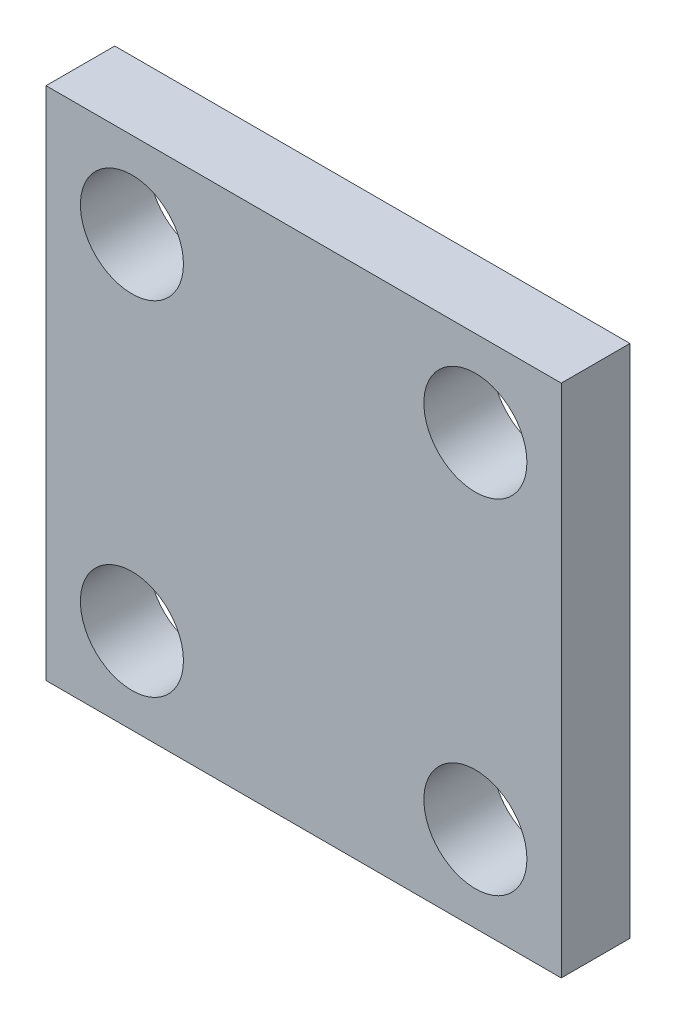
ISO-10303-21;
HEADER;
FILE_DESCRIPTION(('STEP AP214'),'2;1');
FILE_NAME('part.step','',(''),(''),'','','');
FILE_SCHEMA(('AUTOMOTIVE_DESIGN { 1 0 10303 214 1 1 1 1 }'));
ENDSEC;
DATA;
#1=APPLICATION_CONTEXT('core data for automotive mechanical design processes');
#2=APPLICATION_PROTOCOL_DEFINITION('international standard','automotive_design',2000,#1);
#3=PRODUCT_CONTEXT('',#1,'mechanical');
#4=PRODUCT('Part','Part','',(#3));
#5=PRODUCT_RELATED_PRODUCT_CATEGORY('part','',(#4));
#6=PRODUCT_DEFINITION_FORMATION('','',#4);
#7=PRODUCT_DEFINITION_CONTEXT('part definition',#1,'design');
#8=PRODUCT_DEFINITION('design','',#6,#7);
#9=PRODUCT_DEFINITION_SHAPE('','',#8);
#10=(LENGTH_UNIT() NAMED_UNIT(*) SI_UNIT(.MILLI.,.METRE.));
#11=(NAMED_UNIT(*) PLANE_ANGLE_UNIT() SI_UNIT($,.RADIAN.));
#12=(NAMED_UNIT(*) SI_UNIT($,.STERADIAN.) SOLID_ANGLE_UNIT());
#13=UNCERTAINTY_MEASURE_WITH_UNIT(LENGTH_MEASURE(1.E-05),#10,'distance_accuracy_value','');
#14=(GEOMETRIC_REPRESENTATION_CONTEXT(3) GLOBAL_UNCERTAINTY_ASSIGNED_CONTEXT((#13)) GLOBAL_UNIT_ASSIGNED_CONTEXT((#10,
#11,#12)) REPRESENTATION_CONTEXT('',''));
#15=CARTESIAN_POINT('',(0.,0.,0.));
#16=DIRECTION('',(0.,0.,1.));
#17=DIRECTION('',(1.,0.,0.));
#18=AXIS2_PLACEMENT_3D('',#15,#16,#17);
#19=CARTESIAN_POINT('',(0.,0.,8.));
#20=DIRECTION('',(0.,0.,-1.));
#21=DIRECTION('',(-1.,0.,0.));
#22=AXIS2_PLACEMENT_3D('',#19,#20,#21);
#23=PLANE('',#22);
#24=DIRECTION('',(0.,1.,0.));
#25=VECTOR('',#24,1.);
#26=CARTESIAN_POINT('',(30.,-30.,8.));
#27=LINE('',#26,#25);
#28=CARTESIAN_POINT('',(30.,-30.,8.));
#29=VERTEX_POINT('',#28);
#30=CARTESIAN_POINT('',(30.,30.,8.));
#31=VERTEX_POINT('',#30);
#32=EDGE_CURVE('E92',#29,#31,#27,.T.);
#33=ORIENTED_EDGE('',*,*,#32,.T.);
#34=DIRECTION('',(-1.,0.,0.));
#35=VECTOR('',#34,1.);
#36=CARTESIAN_POINT('',(-30.,30.,8.));
#37=LINE('',#36,#35);
#38=CARTESIAN_POINT('',(-30.,30.,8.));
#39=VERTEX_POINT('',#38);
#40=EDGE_CURVE('E87',#31,#39,#37,.T.);
#41=ORIENTED_EDGE('',*,*,#40,.T.);
#42=DIRECTION('',(0.,-1.,0.));
#43=VECTOR('',#42,1.);
#44=CARTESIAN_POINT('',(-30.,-30.,8.));
#45=LINE('',#44,#43);
#46=CARTESIAN_POINT('',(-30.,-30.,8.));
#47=VERTEX_POINT('',#46);
#48=EDGE_CURVE('E90',#39,#47,#45,.T.);
#49=ORIENTED_EDGE('',*,*,#48,.T.);
#50=DIRECTION('',(1.,0.,0.));
#51=VECTOR('',#50,1.);
#52=CARTESIAN_POINT('',(-30.,-30.,8.));
#53=LINE('',#52,#51);
#54=EDGE_CURVE('E57',#47,#29,#53,.T.);
#55=ORIENTED_EDGE('',*,*,#54,.T.);
#56=EDGE_LOOP('',(#33,#41,#49,#55));
#57=FACE_BOUND('',#56,.T.);
#58=CARTESIAN_POINT('',(-19.9999991568675,19.9999991568675,8.));
#59=DIRECTION('',(0.,0.,1.));
#60=DIRECTION('',(1.,0.,0.));
#61=AXIS2_PLACEMENT_3D('',#58,#59,#60);
#62=CIRCLE('',#61,6.);
#63=CARTESIAN_POINT('',(-13.9999991568675,19.9999991568675,8.));
#64=VERTEX_POINT('',#63);
#65=EDGE_CURVE('E112',#64,#64,#62,.T.);
#66=ORIENTED_EDGE('',*,*,#65,.F.);
#67=EDGE_LOOP('',(#66));
#68=FACE_BOUND('',#67,.T.);
#69=CARTESIAN_POINT('',(20.0000008431325,20.0000008431325,8.));
#70=DIRECTION('',(0.,0.,1.));
#71=DIRECTION('',(1.,0.,0.));
#72=AXIS2_PLACEMENT_3D('',#69,#70,#71);
#73=CIRCLE('',#72,6.);
#74=CARTESIAN_POINT('',(26.0000008431325,20.0000008431325,8.));
#75=VERTEX_POINT('',#74);
#76=EDGE_CURVE('E134',#75,#75,#73,.T.);
#77=ORIENTED_EDGE('',*,*,#76,.F.);
#78=EDGE_LOOP('',(#77));
#79=FACE_BOUND('',#78,.T.);
#80=CARTESIAN_POINT('',(-20.0000008431325,-20.0000008431325,8.));
#81=DIRECTION('',(0.,0.,1.));
#82=DIRECTION('',(1.,0.,0.));
#83=AXIS2_PLACEMENT_3D('',#80,#81,#82);
#84=CIRCLE('',#83,6.);
#85=CARTESIAN_POINT('',(-14.0000008431325,-20.0000008431325,8.));
#86=VERTEX_POINT('',#85);
#87=EDGE_CURVE('E142',#86,#86,#84,.T.);
#88=ORIENTED_EDGE('',*,*,#87,.F.);
#89=EDGE_LOOP('',(#88));
#90=FACE_BOUND('',#89,.T.);
#91=CARTESIAN_POINT('',(19.9999991568675,-19.9999991568675,8.));
#92=DIRECTION('',(0.,0.,1.));
#93=DIRECTION('',(1.,0.,0.));
#94=AXIS2_PLACEMENT_3D('',#91,#92,#93);
#95=CIRCLE('',#94,6.);
#96=CARTESIAN_POINT('',(25.9999991568675,-19.9999991568675,8.));
#97=VERTEX_POINT('',#96);
#98=EDGE_CURVE('E150',#97,#97,#95,.T.);
#99=ORIENTED_EDGE('',*,*,#98,.F.);
#100=EDGE_LOOP('',(#99));
#101=FACE_BOUND('',#100,.T.);
#102=ADVANCED_FACE('F39',(#57,#68,#79,#90,#101),#23,.F.);
#103=CARTESIAN_POINT('',(0.,0.,0.));
#104=DIRECTION('',(0.,0.,-1.));
#105=DIRECTION('',(-1.,0.,0.));
#106=AXIS2_PLACEMENT_3D('',#103,#104,#105);
#107=PLANE('',#106);
#108=CARTESIAN_POINT('',(-20.0000008431325,-20.0000008431325,0.));
#109=DIRECTION('',(0.,0.,1.));
#110=DIRECTION('',(1.,0.,0.));
#111=AXIS2_PLACEMENT_3D('',#108,#109,#110);
#112=CIRCLE('',#111,6.);
#113=CARTESIAN_POINT('',(-14.0000008431325,-20.0000008431325,0.));
#114=VERTEX_POINT('',#113);
#115=EDGE_CURVE('E146',#114,#114,#112,.T.);
#116=ORIENTED_EDGE('',*,*,#115,.T.);
#117=EDGE_LOOP('',(#116));
#118=FACE_BOUND('',#117,.T.);
#119=CARTESIAN_POINT('',(-19.9999991568675,19.9999991568675,0.));
#120=DIRECTION('',(0.,0.,1.));
#121=DIRECTION('',(1.,0.,0.));
#122=AXIS2_PLACEMENT_3D('',#119,#120,#121);
#123=CIRCLE('',#122,6.);
#124=CARTESIAN_POINT('',(-13.9999991568675,19.9999991568675,0.));
#125=VERTEX_POINT('',#124);
#126=EDGE_CURVE('E130',#125,#125,#123,.T.);
#127=ORIENTED_EDGE('',*,*,#126,.T.);
#128=EDGE_LOOP('',(#127));
#129=FACE_BOUND('',#128,.T.);
#130=DIRECTION('',(0.,1.,0.));
#131=VECTOR('',#130,1.);
#132=CARTESIAN_POINT('',(30.,-30.,0.));
#133=LINE('',#132,#131);
#134=CARTESIAN_POINT('',(30.,-30.,0.));
#135=VERTEX_POINT('',#134);
#136=CARTESIAN_POINT('',(30.,30.,0.));
#137=VERTEX_POINT('',#136);
#138=EDGE_CURVE('E108',#135,#137,#133,.T.);
#139=ORIENTED_EDGE('',*,*,#138,.F.);
#140=DIRECTION('',(1.,0.,0.));
#141=VECTOR('',#140,1.);
#142=CARTESIAN_POINT('',(-30.,-30.,0.));
#143=LINE('',#142,#141);
#144=CARTESIAN_POINT('',(-30.,-30.,0.));
#145=VERTEX_POINT('',#144);
#146=EDGE_CURVE('E80',#145,#135,#143,.T.);
#147=ORIENTED_EDGE('',*,*,#146,.F.);
#148=DIRECTION('',(0.,-1.,0.));
#149=VECTOR('',#148,1.);
#150=CARTESIAN_POINT('',(-30.,-30.,0.));
#151=LINE('',#150,#149);
#152=CARTESIAN_POINT('',(-30.,30.,0.));
#153=VERTEX_POINT('',#152);
#154=EDGE_CURVE('E74',#153,#145,#151,.T.);
#155=ORIENTED_EDGE('',*,*,#154,.F.);
#156=DIRECTION('',(-1.,0.,0.));
#157=VECTOR('',#156,1.);
#158=CARTESIAN_POINT('',(-30.,30.,0.));
#159=LINE('',#158,#157);
#160=EDGE_CURVE('E97',#137,#153,#159,.T.);
#161=ORIENTED_EDGE('',*,*,#160,.F.);
#162=EDGE_LOOP('',(#139,#147,#155,#161));
#163=FACE_BOUND('',#162,.T.);
#164=CARTESIAN_POINT('',(20.0000008431325,20.0000008431325,0.));
#165=DIRECTION('',(0.,0.,1.));
#166=DIRECTION('',(1.,0.,0.));
#167=AXIS2_PLACEMENT_3D('',#164,#165,#166);
#168=CIRCLE('',#167,6.);
#169=CARTESIAN_POINT('',(26.0000008431325,20.0000008431325,0.));
#170=VERTEX_POINT('',#169);
#171=EDGE_CURVE('E138',#170,#170,#168,.T.);
#172=ORIENTED_EDGE('',*,*,#171,.T.);
#173=EDGE_LOOP('',(#172));
#174=FACE_BOUND('',#173,.T.);
#175=CARTESIAN_POINT('',(19.9999991568675,-19.9999991568675,0.));
#176=DIRECTION('',(0.,0.,1.));
#177=DIRECTION('',(1.,0.,0.));
#178=AXIS2_PLACEMENT_3D('',#175,#176,#177);
#179=CIRCLE('',#178,6.);
#180=CARTESIAN_POINT('',(25.9999991568675,-19.9999991568675,0.));
#181=VERTEX_POINT('',#180);
#182=EDGE_CURVE('E154',#181,#181,#179,.T.);
#183=ORIENTED_EDGE('',*,*,#182,.T.);
#184=EDGE_LOOP('',(#183));
#185=FACE_BOUND('',#184,.T.);
#186=ADVANCED_FACE('F125',(#118,#129,#163,#174,#185),#107,.T.);
#187=CARTESIAN_POINT('',(30.,-30.,8.));
#188=DIRECTION('',(-1.,0.,0.));
#189=DIRECTION('',(0.,0.,1.));
#190=AXIS2_PLACEMENT_3D('',#187,#188,#189);
#191=PLANE('',#190);
#192=ORIENTED_EDGE('',*,*,#138,.T.);
#193=DIRECTION('',(0.,0.,-1.));
#194=VECTOR('',#193,1.);
#195=CARTESIAN_POINT('',(30.,30.,8.));
#196=LINE('',#195,#194);
#197=EDGE_CURVE('E11',#31,#137,#196,.T.);
#198=ORIENTED_EDGE('',*,*,#197,.F.);
#199=ORIENTED_EDGE('',*,*,#32,.F.);
#200=DIRECTION('',(0.,0.,-1.));
#201=VECTOR('',#200,1.);
#202=CARTESIAN_POINT('',(30.,-30.,8.));
#203=LINE('',#202,#201);
#204=EDGE_CURVE('E104',#29,#135,#203,.T.);
#205=ORIENTED_EDGE('',*,*,#204,.T.);
#206=EDGE_LOOP('',(#192,#198,#199,#205));
#207=FACE_BOUND('',#206,.T.);
#208=ADVANCED_FACE('F41',(#207),#191,.F.);
#209=CARTESIAN_POINT('',(-30.,30.,8.));
#210=DIRECTION('',(0.,-1.,0.));
#211=DIRECTION('',(0.,0.,-1.));
#212=AXIS2_PLACEMENT_3D('',#209,#210,#211);
#213=PLANE('',#212);
#214=ORIENTED_EDGE('',*,*,#160,.T.);
#215=DIRECTION('',(0.,0.,-1.));
#216=VECTOR('',#215,1.);
#217=CARTESIAN_POINT('',(-30.,30.,8.));
#218=LINE('',#217,#216);
#219=EDGE_CURVE('E49',#39,#153,#218,.T.);
#220=ORIENTED_EDGE('',*,*,#219,.F.);
#221=ORIENTED_EDGE('',*,*,#40,.F.);
#222=ORIENTED_EDGE('',*,*,#197,.T.);
#223=EDGE_LOOP('',(#214,#220,#221,#222));
#224=FACE_BOUND('',#223,.T.);
#225=ADVANCED_FACE('F96',(#224),#213,.F.);
#226=CARTESIAN_POINT('',(-30.,-30.,8.));
#227=DIRECTION('',(1.,0.,0.));
#228=DIRECTION('',(0.,0.,-1.));
#229=AXIS2_PLACEMENT_3D('',#226,#227,#228);
#230=PLANE('',#229);
#231=ORIENTED_EDGE('',*,*,#154,.T.);
#232=DIRECTION('',(0.,0.,-1.));
#233=VECTOR('',#232,1.);
#234=CARTESIAN_POINT('',(-30.,-30.,8.));
#235=LINE('',#234,#233);
#236=EDGE_CURVE('E99',#47,#145,#235,.T.);
#237=ORIENTED_EDGE('',*,*,#236,.F.);
#238=ORIENTED_EDGE('',*,*,#48,.F.);
#239=ORIENTED_EDGE('',*,*,#219,.T.);
#240=EDGE_LOOP('',(#231,#237,#238,#239));
#241=FACE_BOUND('',#240,.T.);
#242=ADVANCED_FACE('F100',(#241),#230,.F.);
#243=CARTESIAN_POINT('',(-30.,-30.,8.));
#244=DIRECTION('',(0.,1.,0.));
#245=DIRECTION('',(0.,0.,1.));
#246=AXIS2_PLACEMENT_3D('',#243,#244,#245);
#247=PLANE('',#246);
#248=ORIENTED_EDGE('',*,*,#146,.T.);
#249=ORIENTED_EDGE('',*,*,#204,.F.);
#250=ORIENTED_EDGE('',*,*,#54,.F.);
#251=ORIENTED_EDGE('',*,*,#236,.T.);
#252=EDGE_LOOP('',(#248,#249,#250,#251));
#253=FACE_BOUND('',#252,.T.);
#254=ADVANCED_FACE('F122',(#253),#247,.F.);
#255=CARTESIAN_POINT('',(-19.9999991568675,19.9999991568675,8.));
#256=DIRECTION('',(0.,0.,-1.));
#257=DIRECTION('',(-1.,0.,0.));
#258=AXIS2_PLACEMENT_3D('',#255,#256,#257);
#259=CYLINDRICAL_SURFACE('',#258,6.);
#260=ORIENTED_EDGE('',*,*,#65,.T.);
#261=EDGE_LOOP('',(#260));
#262=FACE_BOUND('',#261,.T.);
#263=ORIENTED_EDGE('',*,*,#126,.F.);
#264=EDGE_LOOP('',(#263));
#265=FACE_BOUND('',#264,.T.);
#266=ADVANCED_FACE('F173',(#262,#265),#259,.F.);
#267=CARTESIAN_POINT('',(20.0000008431325,20.0000008431325,8.));
#268=DIRECTION('',(0.,0.,-1.));
#269=DIRECTION('',(-1.,0.,0.));
#270=AXIS2_PLACEMENT_3D('',#267,#268,#269);
#271=CYLINDRICAL_SURFACE('',#270,6.);
#272=ORIENTED_EDGE('',*,*,#76,.T.);
#273=EDGE_LOOP('',(#272));
#274=FACE_BOUND('',#273,.T.);
#275=ORIENTED_EDGE('',*,*,#171,.F.);
#276=EDGE_LOOP('',(#275));
#277=FACE_BOUND('',#276,.T.);
#278=ADVANCED_FACE('F219',(#274,#277),#271,.F.);
#279=CARTESIAN_POINT('',(-20.0000008431325,-20.0000008431325,8.));
#280=DIRECTION('',(0.,0.,-1.));
#281=DIRECTION('',(-1.,0.,0.));
#282=AXIS2_PLACEMENT_3D('',#279,#280,#281);
#283=CYLINDRICAL_SURFACE('',#282,6.);
#284=ORIENTED_EDGE('',*,*,#87,.T.);
#285=EDGE_LOOP('',(#284));
#286=FACE_BOUND('',#285,.T.);
#287=ORIENTED_EDGE('',*,*,#115,.F.);
#288=EDGE_LOOP('',(#287));
#289=FACE_BOUND('',#288,.T.);
#290=ADVANCED_FACE('F227',(#286,#289),#283,.F.);
#291=CARTESIAN_POINT('',(19.9999991568675,-19.9999991568675,8.));
#292=DIRECTION('',(0.,0.,-1.));
#293=DIRECTION('',(-1.,0.,0.));
#294=AXIS2_PLACEMENT_3D('',#291,#292,#293);
#295=CYLINDRICAL_SURFACE('',#294,6.);
#296=ORIENTED_EDGE('',*,*,#98,.T.);
#297=EDGE_LOOP('',(#296));
#298=FACE_BOUND('',#297,.T.);
#299=ORIENTED_EDGE('',*,*,#182,.F.);
#300=EDGE_LOOP('',(#299));
#301=FACE_BOUND('',#300,.T.);
#302=ADVANCED_FACE('F162',(#298,#301),#295,.F.);
#303=CLOSED_SHELL('',(#102,#186,#208,#225,#242,#254,#266,#278,#290,#302));
#304=MANIFOLD_SOLID_BREP('B2',#303);
#305=ADVANCED_BREP_SHAPE_REPRESENTATION('',(#18,#304),#14);
#306=SHAPE_DEFINITION_REPRESENTATION(#9,#305);
ENDSEC;
END-ISO-10303-21;
